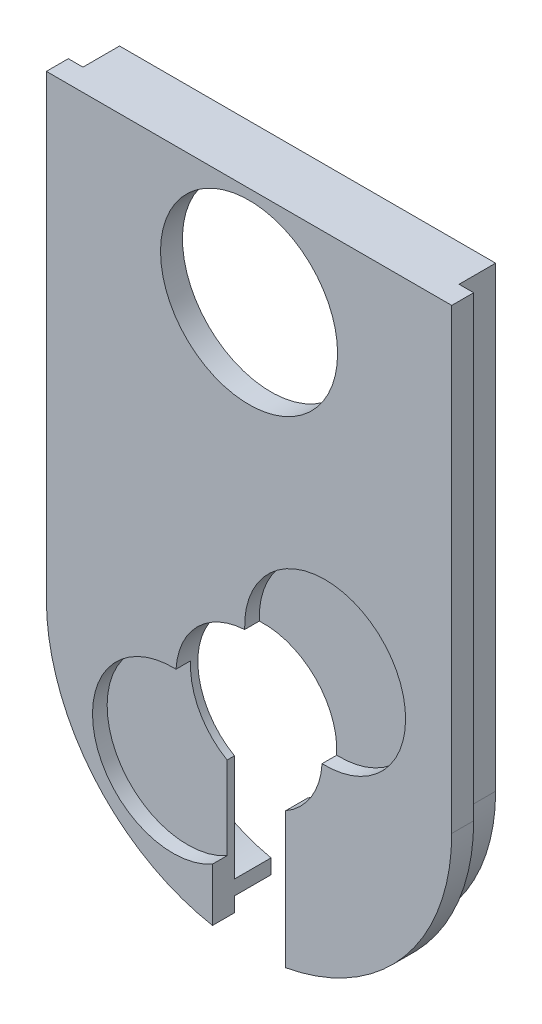
ISO-10303-21;
HEADER;
FILE_DESCRIPTION(('STEP AP214'),'2;1');
FILE_NAME('part.step','',(''),(''),'','','');
FILE_SCHEMA(('AUTOMOTIVE_DESIGN { 1 0 10303 214 1 1 1 1 }'));
ENDSEC;
DATA;
#1=APPLICATION_CONTEXT('core data for automotive mechanical design processes');
#2=APPLICATION_PROTOCOL_DEFINITION('international standard','automotive_design',2000,#1);
#3=PRODUCT_CONTEXT('',#1,'mechanical');
#4=PRODUCT('Part','Part','',(#3));
#5=PRODUCT_RELATED_PRODUCT_CATEGORY('part','',(#4));
#6=PRODUCT_DEFINITION_FORMATION('','',#4);
#7=PRODUCT_DEFINITION_CONTEXT('part definition',#1,'design');
#8=PRODUCT_DEFINITION('design','',#6,#7);
#9=PRODUCT_DEFINITION_SHAPE('','',#8);
#10=(LENGTH_UNIT() NAMED_UNIT(*) SI_UNIT(.MILLI.,.METRE.));
#11=(NAMED_UNIT(*) PLANE_ANGLE_UNIT() SI_UNIT($,.RADIAN.));
#12=(NAMED_UNIT(*) SI_UNIT($,.STERADIAN.) SOLID_ANGLE_UNIT());
#13=UNCERTAINTY_MEASURE_WITH_UNIT(LENGTH_MEASURE(1.E-05),#10,'distance_accuracy_value','');
#14=(GEOMETRIC_REPRESENTATION_CONTEXT(3) GLOBAL_UNCERTAINTY_ASSIGNED_CONTEXT((#13)) GLOBAL_UNIT_ASSIGNED_CONTEXT((#10,
#11,#12)) REPRESENTATION_CONTEXT('',''));
#15=CARTESIAN_POINT('',(0.,0.,0.));
#16=DIRECTION('',(0.,0.,1.));
#17=DIRECTION('',(1.,0.,0.));
#18=AXIS2_PLACEMENT_3D('',#15,#16,#17);
#19=CARTESIAN_POINT('',(0.,0.,0.));
#20=DIRECTION('',(0.,0.,-1.));
#21=DIRECTION('',(-1.,0.,0.));
#22=AXIS2_PLACEMENT_3D('',#19,#20,#21);
#23=PLANE('',#22);
#24=DIRECTION('',(0.,1.,0.));
#25=VECTOR('',#24,1.);
#26=CARTESIAN_POINT('',(-25.7,62.5,0.));
#27=LINE('',#26,#25);
#28=CARTESIAN_POINT('',(-25.7,0.,0.));
#29=VERTEX_POINT('',#28);
#30=CARTESIAN_POINT('',(-25.7,62.5,0.));
#31=VERTEX_POINT('',#30);
#32=EDGE_CURVE('E11',#29,#31,#27,.T.);
#33=ORIENTED_EDGE('',*,*,#32,.F.);
#34=CARTESIAN_POINT('',(0.0439613969854986,0.,0.));
#35=DIRECTION('',(0.,0.,-1.));
#36=DIRECTION('',(1.,0.,0.));
#37=AXIS2_PLACEMENT_3D('',#34,#35,#36);
#38=CIRCLE('',#37,25.7439613969855);
#39=CARTESIAN_POINT('',(-5.,-25.2449995412002,0.));
#40=VERTEX_POINT('',#39);
#41=EDGE_CURVE('E272',#40,#29,#38,.T.);
#42=ORIENTED_EDGE('',*,*,#41,.F.);
#43=DIRECTION('',(0.,-1.,0.));
#44=VECTOR('',#43,1.);
#45=CARTESIAN_POINT('',(-5.,-27.7,0.));
#46=LINE('',#45,#44);
#47=CARTESIAN_POINT('',(-5.,-27.2449995412002,0.));
#48=VERTEX_POINT('',#47);
#49=EDGE_CURVE('E471',#40,#48,#46,.T.);
#50=ORIENTED_EDGE('',*,*,#49,.T.);
#51=CARTESIAN_POINT('',(0.,0.,0.));
#52=DIRECTION('',(0.,0.,1.));
#53=DIRECTION('',(1.,0.,0.));
#54=AXIS2_PLACEMENT_3D('',#51,#52,#53);
#55=CIRCLE('',#54,27.7);
#56=CARTESIAN_POINT('',(-27.7,0.,0.));
#57=VERTEX_POINT('',#56);
#58=EDGE_CURVE('E241',#57,#48,#55,.T.);
#59=ORIENTED_EDGE('',*,*,#58,.F.);
#60=DIRECTION('',(0.,-1.,0.));
#61=VECTOR('',#60,1.);
#62=CARTESIAN_POINT('',(-27.7,0.,0.));
#63=LINE('',#62,#61);
#64=CARTESIAN_POINT('',(-27.7,62.5,0.));
#65=VERTEX_POINT('',#64);
#66=EDGE_CURVE('E395',#65,#57,#63,.T.);
#67=ORIENTED_EDGE('',*,*,#66,.F.);
#68=DIRECTION('',(-1.,0.,0.));
#69=VECTOR('',#68,1.);
#70=CARTESIAN_POINT('',(-27.7,62.5,0.));
#71=LINE('',#70,#69);
#72=EDGE_CURVE('E389',#31,#65,#71,.T.);
#73=ORIENTED_EDGE('',*,*,#72,.F.);
#74=EDGE_LOOP('',(#33,#42,#50,#59,#67,#73));
#75=FACE_BOUND('',#74,.T.);
#76=ADVANCED_FACE('F39',(#75),#23,.T.);
#77=DIRECTION('',(0.,-1.,0.));
#78=VECTOR('',#77,1.);
#79=CARTESIAN_POINT('',(-23.7,61.1,0.));
#80=LINE('',#79,#78);
#81=CARTESIAN_POINT('',(-23.7,61.1,0.));
#82=VERTEX_POINT('',#81);
#83=CARTESIAN_POINT('',(-23.7,0.,0.));
#84=VERTEX_POINT('',#83);
#85=EDGE_CURVE('E57',#82,#84,#80,.T.);
#86=ORIENTED_EDGE('',*,*,#85,.F.);
#87=DIRECTION('',(-1.,0.,0.));
#88=VECTOR('',#87,1.);
#89=CARTESIAN_POINT('',(23.7,61.1,0.));
#90=LINE('',#89,#88);
#91=CARTESIAN_POINT('',(0.,61.1,0.));
#92=VERTEX_POINT('',#91);
#93=EDGE_CURVE('E49',#92,#82,#90,.T.);
#94=ORIENTED_EDGE('',*,*,#93,.F.);
#95=CARTESIAN_POINT('',(0.,49.,0.));
#96=DIRECTION('',(0.,0.,1.));
#97=DIRECTION('',(1.,0.,0.));
#98=AXIS2_PLACEMENT_3D('',#95,#96,#97);
#99=CIRCLE('',#98,12.1);
#100=EDGE_CURVE('E378',#92,#92,#99,.T.);
#101=ORIENTED_EDGE('',*,*,#100,.T.);
#102=CARTESIAN_POINT('',(23.7,61.1,0.));
#103=VERTEX_POINT('',#102);
#104=EDGE_CURVE('E64',#103,#92,#90,.T.);
#105=ORIENTED_EDGE('',*,*,#104,.F.);
#106=DIRECTION('',(0.,1.,0.));
#107=VECTOR('',#106,1.);
#108=CARTESIAN_POINT('',(23.7,61.1,0.));
#109=LINE('',#108,#107);
#110=CARTESIAN_POINT('',(23.7,0.,0.));
#111=VERTEX_POINT('',#110);
#112=EDGE_CURVE('E316',#111,#103,#109,.T.);
#113=ORIENTED_EDGE('',*,*,#112,.F.);
#114=CARTESIAN_POINT('',(-0.0973263013475528,0.,0.));
#115=DIRECTION('',(0.,0.,1.));
#116=DIRECTION('',(-1.,0.,0.));
#117=AXIS2_PLACEMENT_3D('',#114,#115,#116);
#118=CIRCLE('',#117,23.7973263013475);
#119=CARTESIAN_POINT('',(5.,-23.2449995412002,0.));
#120=VERTEX_POINT('',#119);
#121=EDGE_CURVE('E312',#120,#111,#118,.T.);
#122=ORIENTED_EDGE('',*,*,#121,.F.);
#123=DIRECTION('',(0.,1.,0.));
#124=VECTOR('',#123,1.);
#125=CARTESIAN_POINT('',(5.,0.,0.));
#126=LINE('',#125,#124);
#127=CARTESIAN_POINT('',(5.,-8.66025403784439,0.));
#128=VERTEX_POINT('',#127);
#129=EDGE_CURVE('E586',#120,#128,#126,.T.);
#130=ORIENTED_EDGE('',*,*,#129,.T.);
#131=CARTESIAN_POINT('',(0.,0.,0.));
#132=DIRECTION('',(0.,0.,1.));
#133=DIRECTION('',(1.,0.,0.));
#134=AXIS2_PLACEMENT_3D('',#131,#132,#133);
#135=CIRCLE('',#134,10.);
#136=CARTESIAN_POINT('',(-5.,-8.66025403784439,0.));
#137=VERTEX_POINT('',#136);
#138=EDGE_CURVE('E480',#128,#137,#135,.T.);
#139=ORIENTED_EDGE('',*,*,#138,.T.);
#140=CARTESIAN_POINT('',(-5.,-23.2449995412002,0.));
#141=VERTEX_POINT('',#140);
#142=EDGE_CURVE('E582',#137,#141,#46,.T.);
#143=ORIENTED_EDGE('',*,*,#142,.T.);
#144=CARTESIAN_POINT('',(0.0973263013475528,0.,0.));
#145=DIRECTION('',(0.,0.,1.));
#146=DIRECTION('',(1.,0.,0.));
#147=AXIS2_PLACEMENT_3D('',#144,#145,#146);
#148=CIRCLE('',#147,23.7973263013475);
#149=EDGE_CURVE('E324',#84,#141,#148,.T.);
#150=ORIENTED_EDGE('',*,*,#149,.F.);
#151=EDGE_LOOP('',(#86,#94,#101,#105,#113,#122,#130,#139,#143,#150));
#152=FACE_BOUND('',#151,.T.);
#153=ADVANCED_FACE('F437',(#152),#23,.T.);
#154=CARTESIAN_POINT('',(-27.7,0.,0.));
#155=DIRECTION('',(-1.,0.,0.));
#156=DIRECTION('',(0.,0.,1.));
#157=AXIS2_PLACEMENT_3D('',#154,#155,#156);
#158=PLANE('',#157);
#159=DIRECTION('',(0.,-1.,0.));
#160=VECTOR('',#159,1.);
#161=CARTESIAN_POINT('',(-27.7,0.,3.));
#162=LINE('',#161,#160);
#163=CARTESIAN_POINT('',(-27.7,62.5,3.));
#164=VERTEX_POINT('',#163);
#165=CARTESIAN_POINT('',(-27.7,0.,3.));
#166=VERTEX_POINT('',#165);
#167=EDGE_CURVE('E390',#164,#166,#162,.T.);
#168=ORIENTED_EDGE('',*,*,#167,.F.);
#169=DIRECTION('',(0.,0.,1.));
#170=VECTOR('',#169,1.);
#171=CARTESIAN_POINT('',(-27.7,62.5,0.));
#172=LINE('',#171,#170);
#173=EDGE_CURVE('E411',#65,#164,#172,.T.);
#174=ORIENTED_EDGE('',*,*,#173,.F.);
#175=ORIENTED_EDGE('',*,*,#66,.T.);
#176=DIRECTION('',(0.,0.,1.));
#177=VECTOR('',#176,1.);
#178=CARTESIAN_POINT('',(-27.7,0.,0.));
#179=LINE('',#178,#177);
#180=EDGE_CURVE('E319',#57,#166,#179,.T.);
#181=ORIENTED_EDGE('',*,*,#180,.T.);
#182=EDGE_LOOP('',(#168,#174,#175,#181));
#183=FACE_BOUND('',#182,.T.);
#184=ADVANCED_FACE('F439',(#183),#158,.T.);
#185=CARTESIAN_POINT('',(-27.7,62.5,0.));
#186=DIRECTION('',(0.,1.,0.));
#187=DIRECTION('',(0.,0.,1.));
#188=AXIS2_PLACEMENT_3D('',#185,#186,#187);
#189=PLANE('',#188);
#190=DIRECTION('',(-1.,0.,0.));
#191=VECTOR('',#190,1.);
#192=CARTESIAN_POINT('',(-27.7,62.5,3.));
#193=LINE('',#192,#191);
#194=CARTESIAN_POINT('',(27.7,62.5,3.));
#195=VERTEX_POINT('',#194);
#196=EDGE_CURVE('E402',#195,#164,#193,.T.);
#197=ORIENTED_EDGE('',*,*,#196,.F.);
#198=DIRECTION('',(0.,0.,1.));
#199=VECTOR('',#198,1.);
#200=CARTESIAN_POINT('',(27.7,62.5,0.));
#201=LINE('',#200,#199);
#202=CARTESIAN_POINT('',(27.7,62.5,0.));
#203=VERTEX_POINT('',#202);
#204=EDGE_CURVE('E413',#203,#195,#201,.T.);
#205=ORIENTED_EDGE('',*,*,#204,.F.);
#206=CARTESIAN_POINT('',(25.7,62.5,0.));
#207=VERTEX_POINT('',#206);
#208=EDGE_CURVE('E391',#203,#207,#71,.T.);
#209=ORIENTED_EDGE('',*,*,#208,.T.);
#210=DIRECTION('',(0.,0.,1.));
#211=VECTOR('',#210,1.);
#212=CARTESIAN_POINT('',(25.7,62.5,-5.));
#213=LINE('',#212,#211);
#214=CARTESIAN_POINT('',(25.7,62.5,-5.));
#215=VERTEX_POINT('',#214);
#216=EDGE_CURVE('E369',#215,#207,#213,.T.);
#217=ORIENTED_EDGE('',*,*,#216,.F.);
#218=DIRECTION('',(1.,0.,0.));
#219=VECTOR('',#218,1.);
#220=CARTESIAN_POINT('',(-25.7,62.5,-5.));
#221=LINE('',#220,#219);
#222=CARTESIAN_POINT('',(-25.7,62.5,-5.));
#223=VERTEX_POINT('',#222);
#224=EDGE_CURVE('E271',#223,#215,#221,.T.);
#225=ORIENTED_EDGE('',*,*,#224,.F.);
#226=DIRECTION('',(0.,0.,1.));
#227=VECTOR('',#226,1.);
#228=CARTESIAN_POINT('',(-25.7,62.5,-5.));
#229=LINE('',#228,#227);
#230=EDGE_CURVE('E373',#223,#31,#229,.T.);
#231=ORIENTED_EDGE('',*,*,#230,.T.);
#232=ORIENTED_EDGE('',*,*,#72,.T.);
#233=ORIENTED_EDGE('',*,*,#173,.T.);
#234=EDGE_LOOP('',(#197,#205,#209,#217,#225,#231,#232,#233));
#235=FACE_BOUND('',#234,.T.);
#236=ADVANCED_FACE('F430',(#235),#189,.T.);
#237=CARTESIAN_POINT('',(27.7,62.5,0.));
#238=DIRECTION('',(1.,0.,0.));
#239=DIRECTION('',(0.,0.,-1.));
#240=AXIS2_PLACEMENT_3D('',#237,#238,#239);
#241=PLANE('',#240);
#242=DIRECTION('',(0.,1.,0.));
#243=VECTOR('',#242,1.);
#244=CARTESIAN_POINT('',(27.7,62.5,3.));
#245=LINE('',#244,#243);
#246=CARTESIAN_POINT('',(27.7,0.,3.));
#247=VERTEX_POINT('',#246);
#248=EDGE_CURVE('E381',#247,#195,#245,.T.);
#249=ORIENTED_EDGE('',*,*,#248,.F.);
#250=DIRECTION('',(0.,0.,1.));
#251=VECTOR('',#250,1.);
#252=CARTESIAN_POINT('',(27.7,0.,0.));
#253=LINE('',#252,#251);
#254=CARTESIAN_POINT('',(27.7,0.,0.));
#255=VERTEX_POINT('',#254);
#256=EDGE_CURVE('E43',#255,#247,#253,.T.);
#257=ORIENTED_EDGE('',*,*,#256,.F.);
#258=DIRECTION('',(0.,1.,0.));
#259=VECTOR('',#258,1.);
#260=CARTESIAN_POINT('',(27.7,62.5,0.));
#261=LINE('',#260,#259);
#262=EDGE_CURVE('E385',#255,#203,#261,.T.);
#263=ORIENTED_EDGE('',*,*,#262,.T.);
#264=ORIENTED_EDGE('',*,*,#204,.T.);
#265=EDGE_LOOP('',(#249,#257,#263,#264));
#266=FACE_BOUND('',#265,.T.);
#267=ADVANCED_FACE('F41',(#266),#241,.T.);
#268=DIRECTION('',(0.,-1.,0.));
#269=VECTOR('',#268,1.);
#270=CARTESIAN_POINT('',(25.7,62.5,0.));
#271=LINE('',#270,#269);
#272=CARTESIAN_POINT('',(25.7,0.,0.));
#273=VERTEX_POINT('',#272);
#274=EDGE_CURVE('E266',#207,#273,#271,.T.);
#275=ORIENTED_EDGE('',*,*,#274,.F.);
#276=ORIENTED_EDGE('',*,*,#208,.F.);
#277=ORIENTED_EDGE('',*,*,#262,.F.);
#278=CARTESIAN_POINT('',(5.,-27.2449995412002,0.));
#279=VERTEX_POINT('',#278);
#280=EDGE_CURVE('E253',#279,#255,#55,.T.);
#281=ORIENTED_EDGE('',*,*,#280,.F.);
#282=CARTESIAN_POINT('',(5.,-25.2449995412002,0.));
#283=VERTEX_POINT('',#282);
#284=EDGE_CURVE('E589',#279,#283,#126,.T.);
#285=ORIENTED_EDGE('',*,*,#284,.T.);
#286=CARTESIAN_POINT('',(-0.0439613969854848,0.,0.));
#287=DIRECTION('',(0.,0.,-1.));
#288=DIRECTION('',(-1.,0.,0.));
#289=AXIS2_PLACEMENT_3D('',#286,#287,#288);
#290=CIRCLE('',#289,25.7439613969855);
#291=EDGE_CURVE('E308',#273,#283,#290,.T.);
#292=ORIENTED_EDGE('',*,*,#291,.F.);
#293=EDGE_LOOP('',(#275,#276,#277,#281,#285,#292));
#294=FACE_BOUND('',#293,.T.);
#295=ADVANCED_FACE('F429',(#294),#23,.T.);
#296=CARTESIAN_POINT('',(0.,0.,3.));
#297=DIRECTION('',(0.,0.,-1.));
#298=DIRECTION('',(-1.,0.,0.));
#299=AXIS2_PLACEMENT_3D('',#296,#297,#298);
#300=PLANE('',#299);
#301=CARTESIAN_POINT('',(0.,49.,3.));
#302=DIRECTION('',(0.,0.,1.));
#303=DIRECTION('',(1.,0.,0.));
#304=AXIS2_PLACEMENT_3D('',#301,#302,#303);
#305=CIRCLE('',#304,12.1);
#306=CARTESIAN_POINT('',(12.1000000000001,49.,3.));
#307=VERTEX_POINT('',#306);
#308=EDGE_CURVE('E377',#307,#307,#305,.T.);
#309=ORIENTED_EDGE('',*,*,#308,.F.);
#310=EDGE_LOOP('',(#309));
#311=FACE_BOUND('',#310,.T.);
#312=ORIENTED_EDGE('',*,*,#167,.T.);
#313=CARTESIAN_POINT('',(0.,0.,3.));
#314=DIRECTION('',(0.,0.,1.));
#315=DIRECTION('',(1.,0.,0.));
#316=AXIS2_PLACEMENT_3D('',#313,#314,#315);
#317=CIRCLE('',#316,27.7);
#318=CARTESIAN_POINT('',(-5.,-27.2449995412002,3.));
#319=VERTEX_POINT('',#318);
#320=EDGE_CURVE('E228',#166,#319,#317,.T.);
#321=ORIENTED_EDGE('',*,*,#320,.T.);
#322=DIRECTION('',(0.,-1.,0.));
#323=VECTOR('',#322,1.);
#324=CARTESIAN_POINT('',(-5.,-27.7,3.));
#325=LINE('',#324,#323);
#326=CARTESIAN_POINT('',(-5.,-19.9809026402007,3.));
#327=VERTEX_POINT('',#326);
#328=EDGE_CURVE('E211',#327,#319,#325,.T.);
#329=ORIENTED_EDGE('',*,*,#328,.F.);
#330=CARTESIAN_POINT('',(-10.3944696834422,-10.3944696834423,3.));
#331=DIRECTION('',(0.,0.,1.));
#332=DIRECTION('',(1.,0.,0.));
#333=AXIS2_PLACEMENT_3D('',#330,#331,#332);
#334=CIRCLE('',#333,11.);
#335=CARTESIAN_POINT('',(-9.9821158432974,0.597798704407277,3.));
#336=VERTEX_POINT('',#335);
#337=EDGE_CURVE('E227',#336,#327,#334,.T.);
#338=ORIENTED_EDGE('',*,*,#337,.F.);
#339=CARTESIAN_POINT('',(0.,0.,3.));
#340=DIRECTION('',(0.,0.,1.));
#341=DIRECTION('',(1.,0.,0.));
#342=AXIS2_PLACEMENT_3D('',#339,#340,#341);
#343=CIRCLE('',#342,10.);
#344=CARTESIAN_POINT('',(-0.597798704407359,9.9821158432974,3.));
#345=VERTEX_POINT('',#344);
#346=EDGE_CURVE('E485',#345,#336,#343,.T.);
#347=ORIENTED_EDGE('',*,*,#346,.F.);
#348=CARTESIAN_POINT('',(10.3944696834422,10.3944696834422,3.));
#349=DIRECTION('',(0.,0.,1.));
#350=DIRECTION('',(1.,0.,0.));
#351=AXIS2_PLACEMENT_3D('',#348,#349,#350);
#352=CIRCLE('',#351,11.);
#353=CARTESIAN_POINT('',(9.9821158432974,-0.597798704407359,3.));
#354=VERTEX_POINT('',#353);
#355=EDGE_CURVE('E244',#354,#345,#352,.T.);
#356=ORIENTED_EDGE('',*,*,#355,.F.);
#357=CARTESIAN_POINT('',(5.,-8.66025403784439,3.));
#358=VERTEX_POINT('',#357);
#359=EDGE_CURVE('E476',#358,#354,#343,.T.);
#360=ORIENTED_EDGE('',*,*,#359,.F.);
#361=DIRECTION('',(0.,1.,0.));
#362=VECTOR('',#361,1.);
#363=CARTESIAN_POINT('',(5.,0.,3.));
#364=LINE('',#363,#362);
#365=CARTESIAN_POINT('',(5.,-27.2449995412002,3.));
#366=VERTEX_POINT('',#365);
#367=EDGE_CURVE('E230',#366,#358,#364,.T.);
#368=ORIENTED_EDGE('',*,*,#367,.F.);
#369=EDGE_CURVE('E248',#366,#247,#317,.T.);
#370=ORIENTED_EDGE('',*,*,#369,.T.);
#371=ORIENTED_EDGE('',*,*,#248,.T.);
#372=ORIENTED_EDGE('',*,*,#196,.T.);
#373=EDGE_LOOP('',(#312,#321,#329,#338,#347,#356,#360,#368,#370,#371,#372));
#374=FACE_BOUND('',#373,.T.);
#375=ADVANCED_FACE('F225',(#311,#374),#300,.F.);
#376=CARTESIAN_POINT('',(0.,49.,0.));
#377=DIRECTION('',(0.,0.,1.));
#378=DIRECTION('',(1.,0.,0.));
#379=AXIS2_PLACEMENT_3D('',#376,#377,#378);
#380=CYLINDRICAL_SURFACE('',#379,12.1);
#381=ORIENTED_EDGE('',*,*,#100,.F.);
#382=EDGE_LOOP('',(#381));
#383=FACE_BOUND('',#382,.T.);
#384=ORIENTED_EDGE('',*,*,#308,.T.);
#385=EDGE_LOOP('',(#384));
#386=FACE_BOUND('',#385,.T.);
#387=ADVANCED_FACE('F448',(#383,#386),#380,.F.);
#388=CARTESIAN_POINT('',(-25.7,62.5,-5.));
#389=DIRECTION('',(1.,0.,0.));
#390=DIRECTION('',(0.,0.,-1.));
#391=AXIS2_PLACEMENT_3D('',#388,#389,#390);
#392=PLANE('',#391);
#393=DIRECTION('',(0.,0.,1.));
#394=VECTOR('',#393,1.);
#395=CARTESIAN_POINT('',(-25.7,0.,-5.));
#396=LINE('',#395,#394);
#397=CARTESIAN_POINT('',(-25.7,0.,-5.));
#398=VERTEX_POINT('',#397);
#399=EDGE_CURVE('E304',#398,#29,#396,.T.);
#400=ORIENTED_EDGE('',*,*,#399,.T.);
#401=ORIENTED_EDGE('',*,*,#32,.T.);
#402=ORIENTED_EDGE('',*,*,#230,.F.);
#403=DIRECTION('',(0.,1.,0.));
#404=VECTOR('',#403,1.);
#405=CARTESIAN_POINT('',(-25.7,62.5,-5.));
#406=LINE('',#405,#404);
#407=EDGE_CURVE('E267',#398,#223,#406,.T.);
#408=ORIENTED_EDGE('',*,*,#407,.F.);
#409=EDGE_LOOP('',(#400,#401,#402,#408));
#410=FACE_BOUND('',#409,.T.);
#411=ADVANCED_FACE('F570',(#410),#392,.F.);
#412=CARTESIAN_POINT('',(25.7,62.5,-5.));
#413=DIRECTION('',(-1.,0.,0.));
#414=DIRECTION('',(0.,0.,1.));
#415=AXIS2_PLACEMENT_3D('',#412,#413,#414);
#416=PLANE('',#415);
#417=ORIENTED_EDGE('',*,*,#274,.T.);
#418=DIRECTION('',(0.,0.,1.));
#419=VECTOR('',#418,1.);
#420=CARTESIAN_POINT('',(25.7,0.,-5.));
#421=LINE('',#420,#419);
#422=CARTESIAN_POINT('',(25.7,0.,-5.));
#423=VERTEX_POINT('',#422);
#424=EDGE_CURVE('E365',#423,#273,#421,.T.);
#425=ORIENTED_EDGE('',*,*,#424,.F.);
#426=DIRECTION('',(0.,-1.,0.));
#427=VECTOR('',#426,1.);
#428=CARTESIAN_POINT('',(25.7,62.5,-5.));
#429=LINE('',#428,#427);
#430=EDGE_CURVE('E275',#215,#423,#429,.T.);
#431=ORIENTED_EDGE('',*,*,#430,.F.);
#432=ORIENTED_EDGE('',*,*,#216,.T.);
#433=EDGE_LOOP('',(#417,#425,#431,#432));
#434=FACE_BOUND('',#433,.T.);
#435=ADVANCED_FACE('F567',(#434),#416,.F.);
#436=CARTESIAN_POINT('',(-0.0439613969854848,0.,-5.));
#437=DIRECTION('',(0.,0.,1.));
#438=DIRECTION('',(1.,0.,0.));
#439=AXIS2_PLACEMENT_3D('',#436,#437,#438);
#440=CYLINDRICAL_SURFACE('',#439,25.7439613969855);
#441=ORIENTED_EDGE('',*,*,#291,.T.);
#442=DIRECTION('',(0.,0.,1.));
#443=VECTOR('',#442,1.);
#444=CARTESIAN_POINT('',(5.00000000000002,-25.2449995412002,-5.));
#445=LINE('',#444,#443);
#446=CARTESIAN_POINT('',(5.00000000000002,-25.2449995412002,-5.));
#447=VERTEX_POINT('',#446);
#448=EDGE_CURVE('E361',#447,#283,#445,.T.);
#449=ORIENTED_EDGE('',*,*,#448,.F.);
#450=CARTESIAN_POINT('',(-0.0439613969854848,0.,-5.));
#451=DIRECTION('',(0.,0.,-1.));
#452=DIRECTION('',(-1.,0.,0.));
#453=AXIS2_PLACEMENT_3D('',#450,#451,#452);
#454=CIRCLE('',#453,25.7439613969855);
#455=EDGE_CURVE('E278',#423,#447,#454,.T.);
#456=ORIENTED_EDGE('',*,*,#455,.F.);
#457=ORIENTED_EDGE('',*,*,#424,.T.);
#458=EDGE_LOOP('',(#441,#449,#456,#457));
#459=FACE_BOUND('',#458,.T.);
#460=ADVANCED_FACE('F563',(#459),#440,.T.);
#461=CARTESIAN_POINT('',(5.,-25.2449995412002,-5.));
#462=DIRECTION('',(1.,0.,0.));
#463=DIRECTION('',(0.,0.,-1.));
#464=AXIS2_PLACEMENT_3D('',#461,#462,#463);
#465=PLANE('',#464);
#466=ORIENTED_EDGE('',*,*,#448,.T.);
#467=ORIENTED_EDGE('',*,*,#284,.F.);
#468=DIRECTION('',(0.,0.,-1.));
#469=VECTOR('',#468,1.);
#470=CARTESIAN_POINT('',(5.,-27.2449995412002,3.));
#471=LINE('',#470,#469);
#472=EDGE_CURVE('E473',#366,#279,#471,.T.);
#473=ORIENTED_EDGE('',*,*,#472,.F.);
#474=ORIENTED_EDGE('',*,*,#367,.T.);
#475=DIRECTION('',(0.,0.,1.));
#476=VECTOR('',#475,1.);
#477=CARTESIAN_POINT('',(5.,-8.66025403784439,0.));
#478=LINE('',#477,#476);
#479=EDGE_CURVE('E262',#128,#358,#478,.T.);
#480=ORIENTED_EDGE('',*,*,#479,.F.);
#481=ORIENTED_EDGE('',*,*,#129,.F.);
#482=DIRECTION('',(0.,0.,1.));
#483=VECTOR('',#482,1.);
#484=CARTESIAN_POINT('',(5.,-23.2449995412002,-5.));
#485=LINE('',#484,#483);
#486=CARTESIAN_POINT('',(5.,-23.2449995412002,-5.));
#487=VERTEX_POINT('',#486);
#488=EDGE_CURVE('E357',#487,#120,#485,.T.);
#489=ORIENTED_EDGE('',*,*,#488,.F.);
#490=DIRECTION('',(0.,1.,0.));
#491=VECTOR('',#490,1.);
#492=CARTESIAN_POINT('',(5.,-25.2449995412002,-5.));
#493=LINE('',#492,#491);
#494=EDGE_CURVE('E281',#447,#487,#493,.T.);
#495=ORIENTED_EDGE('',*,*,#494,.F.);
#496=EDGE_LOOP('',(#466,#467,#473,#474,#480,#481,#489,#495));
#497=FACE_BOUND('',#496,.T.);
#498=ADVANCED_FACE('F559',(#497),#465,.F.);
#499=CARTESIAN_POINT('',(-0.0973263013475528,0.,-5.));
#500=DIRECTION('',(0.,0.,1.));
#501=DIRECTION('',(1.,0.,0.));
#502=AXIS2_PLACEMENT_3D('',#499,#500,#501);
#503=CYLINDRICAL_SURFACE('',#502,23.7973263013475);
#504=ORIENTED_EDGE('',*,*,#121,.T.);
#505=DIRECTION('',(0.,0.,1.));
#506=VECTOR('',#505,1.);
#507=CARTESIAN_POINT('',(23.7,0.,-5.));
#508=LINE('',#507,#506);
#509=CARTESIAN_POINT('',(23.7,0.,-5.));
#510=VERTEX_POINT('',#509);
#511=EDGE_CURVE('E353',#510,#111,#508,.T.);
#512=ORIENTED_EDGE('',*,*,#511,.F.);
#513=CARTESIAN_POINT('',(-0.0973263013475528,0.,-5.));
#514=DIRECTION('',(0.,0.,1.));
#515=DIRECTION('',(-1.,0.,0.));
#516=AXIS2_PLACEMENT_3D('',#513,#514,#515);
#517=CIRCLE('',#516,23.7973263013475);
#518=EDGE_CURVE('E284',#487,#510,#517,.T.);
#519=ORIENTED_EDGE('',*,*,#518,.F.);
#520=ORIENTED_EDGE('',*,*,#488,.T.);
#521=EDGE_LOOP('',(#504,#512,#519,#520));
#522=FACE_BOUND('',#521,.T.);
#523=ADVANCED_FACE('F555',(#522),#503,.F.);
#524=CARTESIAN_POINT('',(23.7,61.1,-5.));
#525=DIRECTION('',(1.,0.,0.));
#526=DIRECTION('',(0.,1.,0.));
#527=AXIS2_PLACEMENT_3D('',#524,#525,#526);
#528=PLANE('',#527);
#529=ORIENTED_EDGE('',*,*,#511,.T.);
#530=ORIENTED_EDGE('',*,*,#112,.T.);
#531=DIRECTION('',(0.,0.,1.));
#532=VECTOR('',#531,1.);
#533=CARTESIAN_POINT('',(23.7,61.1,-5.));
#534=LINE('',#533,#532);
#535=CARTESIAN_POINT('',(23.7,61.1,-5.));
#536=VERTEX_POINT('',#535);
#537=EDGE_CURVE('E349',#536,#103,#534,.T.);
#538=ORIENTED_EDGE('',*,*,#537,.F.);
#539=DIRECTION('',(0.,1.,0.));
#540=VECTOR('',#539,1.);
#541=CARTESIAN_POINT('',(23.7,61.1,-5.));
#542=LINE('',#541,#540);
#543=EDGE_CURVE('E287',#510,#536,#542,.T.);
#544=ORIENTED_EDGE('',*,*,#543,.F.);
#545=EDGE_LOOP('',(#529,#530,#538,#544));
#546=FACE_BOUND('',#545,.T.);
#547=ADVANCED_FACE('F551',(#546),#528,.F.);
#548=CARTESIAN_POINT('',(23.7,61.1,-5.));
#549=DIRECTION('',(0.,1.,0.));
#550=DIRECTION('',(0.,0.,1.));
#551=AXIS2_PLACEMENT_3D('',#548,#549,#550);
#552=PLANE('',#551);
#553=ORIENTED_EDGE('',*,*,#104,.T.);
#554=ORIENTED_EDGE('',*,*,#93,.T.);
#555=DIRECTION('',(0.,0.,1.));
#556=VECTOR('',#555,1.);
#557=CARTESIAN_POINT('',(-23.7,61.1,-5.));
#558=LINE('',#557,#556);
#559=CARTESIAN_POINT('',(-23.7,61.1,-5.));
#560=VERTEX_POINT('',#559);
#561=EDGE_CURVE('E345',#560,#82,#558,.T.);
#562=ORIENTED_EDGE('',*,*,#561,.F.);
#563=DIRECTION('',(-1.,0.,0.));
#564=VECTOR('',#563,1.);
#565=CARTESIAN_POINT('',(23.7,61.1,-5.));
#566=LINE('',#565,#564);
#567=EDGE_CURVE('E290',#536,#560,#566,.T.);
#568=ORIENTED_EDGE('',*,*,#567,.F.);
#569=ORIENTED_EDGE('',*,*,#537,.T.);
#570=EDGE_LOOP('',(#553,#554,#562,#568,#569));
#571=FACE_BOUND('',#570,.T.);
#572=ADVANCED_FACE('F547',(#571),#552,.F.);
#573=CARTESIAN_POINT('',(-23.7,61.1,-5.));
#574=DIRECTION('',(-1.,0.,0.));
#575=DIRECTION('',(0.,-1.,0.));
#576=AXIS2_PLACEMENT_3D('',#573,#574,#575);
#577=PLANE('',#576);
#578=ORIENTED_EDGE('',*,*,#85,.T.);
#579=DIRECTION('',(0.,0.,1.));
#580=VECTOR('',#579,1.);
#581=CARTESIAN_POINT('',(-23.7,0.,-5.));
#582=LINE('',#581,#580);
#583=CARTESIAN_POINT('',(-23.7,0.,-5.));
#584=VERTEX_POINT('',#583);
#585=EDGE_CURVE('E341',#584,#84,#582,.T.);
#586=ORIENTED_EDGE('',*,*,#585,.F.);
#587=DIRECTION('',(0.,-1.,0.));
#588=VECTOR('',#587,1.);
#589=CARTESIAN_POINT('',(-23.7,61.1,-5.));
#590=LINE('',#589,#588);
#591=EDGE_CURVE('E293',#560,#584,#590,.T.);
#592=ORIENTED_EDGE('',*,*,#591,.F.);
#593=ORIENTED_EDGE('',*,*,#561,.T.);
#594=EDGE_LOOP('',(#578,#586,#592,#593));
#595=FACE_BOUND('',#594,.T.);
#596=ADVANCED_FACE('F543',(#595),#577,.F.);
#597=CARTESIAN_POINT('',(0.0973263013475528,0.,-5.));
#598=DIRECTION('',(0.,0.,1.));
#599=DIRECTION('',(1.,0.,0.));
#600=AXIS2_PLACEMENT_3D('',#597,#598,#599);
#601=CYLINDRICAL_SURFACE('',#600,23.7973263013475);
#602=ORIENTED_EDGE('',*,*,#149,.T.);
#603=DIRECTION('',(0.,0.,1.));
#604=VECTOR('',#603,1.);
#605=CARTESIAN_POINT('',(-5.,-23.2449995412002,-5.));
#606=LINE('',#605,#604);
#607=CARTESIAN_POINT('',(-5.,-23.2449995412002,-5.));
#608=VERTEX_POINT('',#607);
#609=EDGE_CURVE('E338',#608,#141,#606,.T.);
#610=ORIENTED_EDGE('',*,*,#609,.F.);
#611=CARTESIAN_POINT('',(0.0973263013475528,0.,-5.));
#612=DIRECTION('',(0.,0.,1.));
#613=DIRECTION('',(1.,0.,0.));
#614=AXIS2_PLACEMENT_3D('',#611,#612,#613);
#615=CIRCLE('',#614,23.7973263013475);
#616=EDGE_CURVE('E296',#584,#608,#615,.T.);
#617=ORIENTED_EDGE('',*,*,#616,.F.);
#618=ORIENTED_EDGE('',*,*,#585,.T.);
#619=EDGE_LOOP('',(#602,#610,#617,#618));
#620=FACE_BOUND('',#619,.T.);
#621=ADVANCED_FACE('F540',(#620),#601,.F.);
#622=CARTESIAN_POINT('',(-5.,-25.2449995412002,-5.));
#623=DIRECTION('',(-1.,0.,0.));
#624=DIRECTION('',(0.,0.,1.));
#625=AXIS2_PLACEMENT_3D('',#622,#623,#624);
#626=PLANE('',#625);
#627=ORIENTED_EDGE('',*,*,#609,.T.);
#628=ORIENTED_EDGE('',*,*,#142,.F.);
#629=DIRECTION('',(0.,0.,1.));
#630=VECTOR('',#629,1.);
#631=CARTESIAN_POINT('',(-5.,-8.66025403784439,0.));
#632=LINE('',#631,#630);
#633=CARTESIAN_POINT('',(-5.,-8.66025403784439,1.));
#634=VERTEX_POINT('',#633);
#635=EDGE_CURVE('E258',#634,#137,#632,.F.);
#636=ORIENTED_EDGE('',*,*,#635,.F.);
#637=DIRECTION('',(0.,-1.,0.));
#638=VECTOR('',#637,1.);
#639=CARTESIAN_POINT('',(-5.,-10.3944696834423,1.));
#640=LINE('',#639,#638);
#641=CARTESIAN_POINT('',(-5.,-19.9809026402007,1.));
#642=VERTEX_POINT('',#641);
#643=EDGE_CURVE('E214',#634,#642,#640,.T.);
#644=ORIENTED_EDGE('',*,*,#643,.T.);
#645=DIRECTION('',(0.,0.,1.));
#646=VECTOR('',#645,1.);
#647=CARTESIAN_POINT('',(-5.,-19.9809026402007,1.));
#648=LINE('',#647,#646);
#649=EDGE_CURVE('E206',#327,#642,#648,.F.);
#650=ORIENTED_EDGE('',*,*,#649,.F.);
#651=ORIENTED_EDGE('',*,*,#328,.T.);
#652=DIRECTION('',(0.,0.,-1.));
#653=VECTOR('',#652,1.);
#654=CARTESIAN_POINT('',(-5.,-27.2449995412002,3.));
#655=LINE('',#654,#653);
#656=EDGE_CURVE('E220',#48,#319,#655,.F.);
#657=ORIENTED_EDGE('',*,*,#656,.F.);
#658=ORIENTED_EDGE('',*,*,#49,.F.);
#659=DIRECTION('',(0.,0.,1.));
#660=VECTOR('',#659,1.);
#661=CARTESIAN_POINT('',(-5.,-25.2449995412002,-5.));
#662=LINE('',#661,#660);
#663=CARTESIAN_POINT('',(-5.,-25.2449995412002,-5.));
#664=VERTEX_POINT('',#663);
#665=EDGE_CURVE('E334',#664,#40,#662,.T.);
#666=ORIENTED_EDGE('',*,*,#665,.F.);
#667=DIRECTION('',(0.,-1.,0.));
#668=VECTOR('',#667,1.);
#669=CARTESIAN_POINT('',(-5.,-25.2449995412002,-5.));
#670=LINE('',#669,#668);
#671=EDGE_CURVE('E299',#608,#664,#670,.T.);
#672=ORIENTED_EDGE('',*,*,#671,.F.);
#673=EDGE_LOOP('',(#627,#628,#636,#644,#650,#651,#657,#658,#666,#672));
#674=FACE_BOUND('',#673,.T.);
#675=ADVANCED_FACE('F209',(#674),#626,.F.);
#676=CARTESIAN_POINT('',(0.0439613969854986,0.,-5.));
#677=DIRECTION('',(0.,0.,1.));
#678=DIRECTION('',(1.,0.,0.));
#679=AXIS2_PLACEMENT_3D('',#676,#677,#678);
#680=CYLINDRICAL_SURFACE('',#679,25.7439613969855);
#681=ORIENTED_EDGE('',*,*,#41,.T.);
#682=ORIENTED_EDGE('',*,*,#399,.F.);
#683=CARTESIAN_POINT('',(0.0439613969854986,0.,-5.));
#684=DIRECTION('',(0.,0.,-1.));
#685=DIRECTION('',(1.,0.,0.));
#686=AXIS2_PLACEMENT_3D('',#683,#684,#685);
#687=CIRCLE('',#686,25.7439613969855);
#688=EDGE_CURVE('E302',#664,#398,#687,.T.);
#689=ORIENTED_EDGE('',*,*,#688,.F.);
#690=ORIENTED_EDGE('',*,*,#665,.T.);
#691=EDGE_LOOP('',(#681,#682,#689,#690));
#692=FACE_BOUND('',#691,.T.);
#693=ADVANCED_FACE('F533',(#692),#680,.T.);
#694=CARTESIAN_POINT('',(0.0439613969854986,0.,-5.));
#695=DIRECTION('',(0.,0.,1.));
#696=DIRECTION('',(1.,0.,0.));
#697=AXIS2_PLACEMENT_3D('',#694,#695,#696);
#698=PLANE('',#697);
#699=ORIENTED_EDGE('',*,*,#407,.T.);
#700=ORIENTED_EDGE('',*,*,#224,.T.);
#701=ORIENTED_EDGE('',*,*,#430,.T.);
#702=ORIENTED_EDGE('',*,*,#455,.T.);
#703=ORIENTED_EDGE('',*,*,#494,.T.);
#704=ORIENTED_EDGE('',*,*,#518,.T.);
#705=ORIENTED_EDGE('',*,*,#543,.T.);
#706=ORIENTED_EDGE('',*,*,#567,.T.);
#707=ORIENTED_EDGE('',*,*,#591,.T.);
#708=ORIENTED_EDGE('',*,*,#616,.T.);
#709=ORIENTED_EDGE('',*,*,#671,.T.);
#710=ORIENTED_EDGE('',*,*,#688,.T.);
#711=EDGE_LOOP('',(#699,#700,#701,#702,#703,#704,#705,#706,#707,#708,#709,#710));
#712=FACE_BOUND('',#711,.T.);
#713=ADVANCED_FACE('F530',(#712),#698,.F.);
#714=CARTESIAN_POINT('',(0.,0.,3.));
#715=DIRECTION('',(0.,0.,-1.));
#716=DIRECTION('',(-1.,0.,0.));
#717=AXIS2_PLACEMENT_3D('',#714,#715,#716);
#718=CYLINDRICAL_SURFACE('',#717,27.7);
#719=ORIENTED_EDGE('',*,*,#280,.T.);
#720=ORIENTED_EDGE('',*,*,#256,.T.);
#721=ORIENTED_EDGE('',*,*,#369,.F.);
#722=ORIENTED_EDGE('',*,*,#472,.T.);
#723=EDGE_LOOP('',(#719,#720,#721,#722));
#724=FACE_BOUND('',#723,.T.);
#725=ADVANCED_FACE('F422',(#724),#718,.T.);
#726=ORIENTED_EDGE('',*,*,#180,.F.);
#727=ORIENTED_EDGE('',*,*,#58,.T.);
#728=ORIENTED_EDGE('',*,*,#656,.T.);
#729=ORIENTED_EDGE('',*,*,#320,.F.);
#730=EDGE_LOOP('',(#726,#727,#728,#729));
#731=FACE_BOUND('',#730,.T.);
#732=ADVANCED_FACE('F468',(#731),#718,.T.);
#733=CARTESIAN_POINT('',(-10.3944696834422,-10.3944696834423,1.));
#734=DIRECTION('',(0.,0.,1.));
#735=DIRECTION('',(1.,0.,0.));
#736=AXIS2_PLACEMENT_3D('',#733,#734,#735);
#737=CYLINDRICAL_SURFACE('',#736,11.);
#738=ORIENTED_EDGE('',*,*,#337,.T.);
#739=ORIENTED_EDGE('',*,*,#649,.T.);
#740=CARTESIAN_POINT('',(-10.3944696834422,-10.3944696834423,1.));
#741=DIRECTION('',(0.,0.,1.));
#742=DIRECTION('',(1.,0.,0.));
#743=AXIS2_PLACEMENT_3D('',#740,#741,#742);
#744=CIRCLE('',#743,11.);
#745=CARTESIAN_POINT('',(-9.9821158432974,0.597798704407277,1.));
#746=VERTEX_POINT('',#745);
#747=EDGE_CURVE('E236',#746,#642,#744,.T.);
#748=ORIENTED_EDGE('',*,*,#747,.F.);
#749=DIRECTION('',(0.,0.,1.));
#750=VECTOR('',#749,1.);
#751=CARTESIAN_POINT('',(-9.9821158432974,0.597798704407277,1.5));
#752=LINE('',#751,#750);
#753=EDGE_CURVE('E234',#746,#336,#752,.T.);
#754=ORIENTED_EDGE('',*,*,#753,.T.);
#755=EDGE_LOOP('',(#738,#739,#748,#754));
#756=FACE_BOUND('',#755,.T.);
#757=ADVANCED_FACE('F233',(#756),#737,.F.);
#758=CARTESIAN_POINT('',(-10.3944696834422,-10.3944696834423,1.));
#759=DIRECTION('',(0.,0.,1.));
#760=DIRECTION('',(1.,0.,0.));
#761=AXIS2_PLACEMENT_3D('',#758,#759,#760);
#762=PLANE('',#761);
#763=ORIENTED_EDGE('',*,*,#643,.F.);
#764=CARTESIAN_POINT('',(0.,0.,1.));
#765=DIRECTION('',(0.,0.,1.));
#766=DIRECTION('',(1.,0.,0.));
#767=AXIS2_PLACEMENT_3D('',#764,#765,#766);
#768=CIRCLE('',#767,10.);
#769=EDGE_CURVE('E495',#746,#634,#768,.T.);
#770=ORIENTED_EDGE('',*,*,#769,.F.);
#771=ORIENTED_EDGE('',*,*,#747,.T.);
#772=EDGE_LOOP('',(#763,#770,#771));
#773=FACE_BOUND('',#772,.T.);
#774=ADVANCED_FACE('F520',(#773),#762,.T.);
#775=CARTESIAN_POINT('',(10.3944696834422,10.3944696834422,1.));
#776=DIRECTION('',(0.,0.,1.));
#777=DIRECTION('',(1.,0.,0.));
#778=AXIS2_PLACEMENT_3D('',#775,#776,#777);
#779=CYLINDRICAL_SURFACE('',#778,11.);
#780=CARTESIAN_POINT('',(10.3944696834422,10.3944696834422,1.));
#781=DIRECTION('',(0.,0.,1.));
#782=DIRECTION('',(1.,0.,0.));
#783=AXIS2_PLACEMENT_3D('',#780,#781,#782);
#784=CIRCLE('',#783,11.);
#785=CARTESIAN_POINT('',(9.9821158432974,-0.597798704407359,1.));
#786=VERTEX_POINT('',#785);
#787=CARTESIAN_POINT('',(-0.597798704407359,9.9821158432974,1.));
#788=VERTEX_POINT('',#787);
#789=EDGE_CURVE('E237',#786,#788,#784,.T.);
#790=ORIENTED_EDGE('',*,*,#789,.F.);
#791=DIRECTION('',(0.,0.,1.));
#792=VECTOR('',#791,1.);
#793=CARTESIAN_POINT('',(9.9821158432974,-0.597798704407359,1.5));
#794=LINE('',#793,#792);
#795=EDGE_CURVE('E491',#786,#354,#794,.T.);
#796=ORIENTED_EDGE('',*,*,#795,.T.);
#797=ORIENTED_EDGE('',*,*,#355,.T.);
#798=DIRECTION('',(0.,0.,1.));
#799=VECTOR('',#798,1.);
#800=CARTESIAN_POINT('',(-0.597798704407359,9.9821158432974,1.5));
#801=LINE('',#800,#799);
#802=EDGE_CURVE('E484',#345,#788,#801,.F.);
#803=ORIENTED_EDGE('',*,*,#802,.T.);
#804=EDGE_LOOP('',(#790,#796,#797,#803));
#805=FACE_BOUND('',#804,.T.);
#806=ADVANCED_FACE('F505',(#805),#779,.F.);
#807=CARTESIAN_POINT('',(10.3944696834422,10.3944696834422,1.));
#808=DIRECTION('',(0.,0.,1.));
#809=DIRECTION('',(1.,0.,0.));
#810=AXIS2_PLACEMENT_3D('',#807,#808,#809);
#811=PLANE('',#810);
#812=CARTESIAN_POINT('',(0.,0.,1.));
#813=DIRECTION('',(0.,0.,1.));
#814=DIRECTION('',(1.,0.,0.));
#815=AXIS2_PLACEMENT_3D('',#812,#813,#814);
#816=CIRCLE('',#815,10.);
#817=EDGE_CURVE('E252',#786,#788,#816,.T.);
#818=ORIENTED_EDGE('',*,*,#817,.F.);
#819=ORIENTED_EDGE('',*,*,#789,.T.);
#820=EDGE_LOOP('',(#818,#819));
#821=FACE_BOUND('',#820,.T.);
#822=ADVANCED_FACE('F512',(#821),#811,.T.);
#823=CARTESIAN_POINT('',(0.,0.,0.));
#824=DIRECTION('',(0.,0.,1.));
#825=DIRECTION('',(1.,0.,0.));
#826=AXIS2_PLACEMENT_3D('',#823,#824,#825);
#827=CYLINDRICAL_SURFACE('',#826,10.);
#828=ORIENTED_EDGE('',*,*,#138,.F.);
#829=ORIENTED_EDGE('',*,*,#479,.T.);
#830=ORIENTED_EDGE('',*,*,#359,.T.);
#831=ORIENTED_EDGE('',*,*,#795,.F.);
#832=ORIENTED_EDGE('',*,*,#817,.T.);
#833=ORIENTED_EDGE('',*,*,#802,.F.);
#834=ORIENTED_EDGE('',*,*,#346,.T.);
#835=ORIENTED_EDGE('',*,*,#753,.F.);
#836=ORIENTED_EDGE('',*,*,#769,.T.);
#837=ORIENTED_EDGE('',*,*,#635,.T.);
#838=EDGE_LOOP('',(#828,#829,#830,#831,#832,#833,#834,#835,#836,#837));
#839=FACE_BOUND('',#838,.T.);
#840=ADVANCED_FACE('F508',(#839),#827,.F.);
#841=CLOSED_SHELL('',(#76,#153,#184,#236,#267,#295,#375,#387,#411,#435,#460,#498,#523,#547,#572,
#596,#621,#675,#693,#713,#725,#732,#757,#774,#806,#822,#840));
#842=MANIFOLD_SOLID_BREP('B2',#841);
#843=ADVANCED_BREP_SHAPE_REPRESENTATION('',(#18,#842),#14);
#844=SHAPE_DEFINITION_REPRESENTATION(#9,#843);
ENDSEC;
END-ISO-10303-21;
